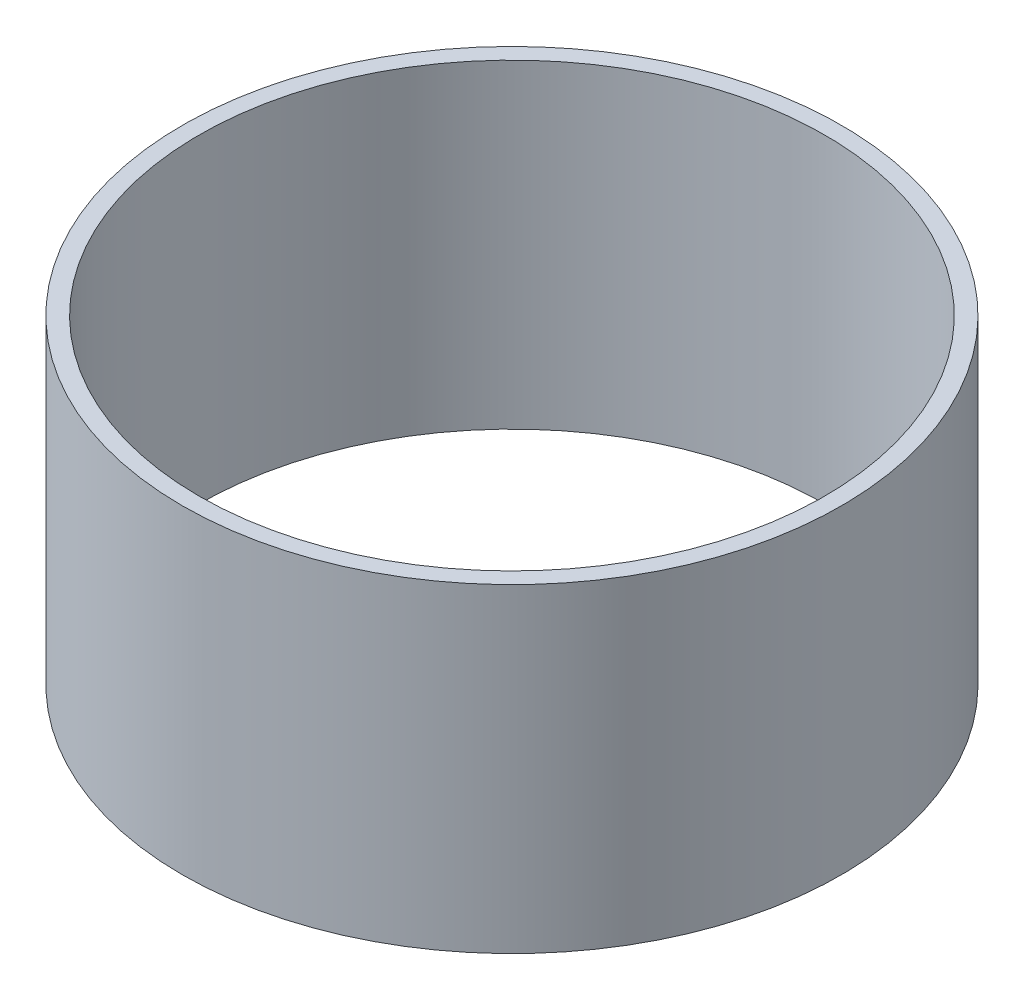
ISO-10303-21;
HEADER;
FILE_DESCRIPTION(('STEP AP214'),'2;1');
FILE_NAME('part.step','',(''),(''),'','','');
FILE_SCHEMA(('AUTOMOTIVE_DESIGN { 1 0 10303 214 1 1 1 1 }'));
ENDSEC;
DATA;
#1=APPLICATION_CONTEXT('core data for automotive mechanical design processes');
#2=APPLICATION_PROTOCOL_DEFINITION('international standard','automotive_design',2000,#1);
#3=PRODUCT_CONTEXT('',#1,'mechanical');
#4=PRODUCT('Part','Part','',(#3));
#5=PRODUCT_RELATED_PRODUCT_CATEGORY('part','',(#4));
#6=PRODUCT_DEFINITION_FORMATION('','',#4);
#7=PRODUCT_DEFINITION_CONTEXT('part definition',#1,'design');
#8=PRODUCT_DEFINITION('design','',#6,#7);
#9=PRODUCT_DEFINITION_SHAPE('','',#8);
#10=(LENGTH_UNIT() NAMED_UNIT(*) SI_UNIT(.MILLI.,.METRE.));
#11=(NAMED_UNIT(*) PLANE_ANGLE_UNIT() SI_UNIT($,.RADIAN.));
#12=(NAMED_UNIT(*) SI_UNIT($,.STERADIAN.) SOLID_ANGLE_UNIT());
#13=UNCERTAINTY_MEASURE_WITH_UNIT(LENGTH_MEASURE(1.E-05),#10,'distance_accuracy_value','');
#14=(GEOMETRIC_REPRESENTATION_CONTEXT(3) GLOBAL_UNCERTAINTY_ASSIGNED_CONTEXT((#13)) GLOBAL_UNIT_ASSIGNED_CONTEXT((#10,
#11,#12)) REPRESENTATION_CONTEXT('',''));
#15=CARTESIAN_POINT('',(0.,0.,0.));
#16=DIRECTION('',(0.,0.,1.));
#17=DIRECTION('',(1.,0.,0.));
#18=AXIS2_PLACEMENT_3D('',#15,#16,#17);
#19=CARTESIAN_POINT('',(0.,45.40758,0.));
#20=DIRECTION('',(0.,1.,0.));
#21=DIRECTION('',(0.,0.,1.));
#22=AXIS2_PLACEMENT_3D('',#19,#20,#21);
#23=PLANE('',#22);
#24=CARTESIAN_POINT('',(0.,45.40758,0.));
#25=DIRECTION('',(0.,1.,0.));
#26=DIRECTION('',(0.,0.,1.));
#27=AXIS2_PLACEMENT_3D('',#24,#25,#26);
#28=CIRCLE('',#27,93.6625);
#29=CARTESIAN_POINT('',(0.,45.40758,93.6625));
#30=VERTEX_POINT('',#29);
#31=EDGE_CURVE('E10',#30,#30,#28,.T.);
#32=ORIENTED_EDGE('',*,*,#31,.T.);
#33=EDGE_LOOP('',(#32));
#34=FACE_BOUND('',#33,.T.);
#35=CARTESIAN_POINT('',(0.,45.40758,0.));
#36=DIRECTION('',(0.,1.,0.));
#37=DIRECTION('',(0.,0.,1.));
#38=AXIS2_PLACEMENT_3D('',#35,#36,#37);
#39=CIRCLE('',#38,88.9);
#40=CARTESIAN_POINT('',(0.,45.40758,88.9));
#41=VERTEX_POINT('',#40);
#42=EDGE_CURVE('E50',#41,#41,#39,.T.);
#43=ORIENTED_EDGE('',*,*,#42,.F.);
#44=EDGE_LOOP('',(#43));
#45=FACE_BOUND('',#44,.T.);
#46=ADVANCED_FACE('F37',(#34,#45),#23,.T.);
#47=CARTESIAN_POINT('',(0.,-45.40758,0.));
#48=DIRECTION('',(0.,1.,0.));
#49=DIRECTION('',(0.,0.,1.));
#50=AXIS2_PLACEMENT_3D('',#47,#48,#49);
#51=PLANE('',#50);
#52=CARTESIAN_POINT('',(0.,-45.40758,0.));
#53=DIRECTION('',(0.,1.,0.));
#54=DIRECTION('',(0.,0.,1.));
#55=AXIS2_PLACEMENT_3D('',#52,#53,#54);
#56=CIRCLE('',#55,93.6625);
#57=CARTESIAN_POINT('',(0.,-45.40758,93.6625));
#58=VERTEX_POINT('',#57);
#59=EDGE_CURVE('E41',#58,#58,#56,.T.);
#60=ORIENTED_EDGE('',*,*,#59,.F.);
#61=EDGE_LOOP('',(#60));
#62=FACE_BOUND('',#61,.T.);
#63=CARTESIAN_POINT('',(0.,-45.40758,0.));
#64=DIRECTION('',(0.,1.,0.));
#65=DIRECTION('',(0.,0.,1.));
#66=AXIS2_PLACEMENT_3D('',#63,#64,#65);
#67=CIRCLE('',#66,88.9);
#68=CARTESIAN_POINT('',(0.,-45.40758,88.9));
#69=VERTEX_POINT('',#68);
#70=EDGE_CURVE('E52',#69,#69,#67,.T.);
#71=ORIENTED_EDGE('',*,*,#70,.T.);
#72=EDGE_LOOP('',(#71));
#73=FACE_BOUND('',#72,.T.);
#74=ADVANCED_FACE('F64',(#62,#73),#51,.F.);
#75=CARTESIAN_POINT('',(0.,45.40758,0.));
#76=DIRECTION('',(0.,-1.,0.));
#77=DIRECTION('',(0.,0.,-1.));
#78=AXIS2_PLACEMENT_3D('',#75,#76,#77);
#79=CYLINDRICAL_SURFACE('',#78,93.6625);
#80=ORIENTED_EDGE('',*,*,#31,.F.);
#81=EDGE_LOOP('',(#80));
#82=FACE_BOUND('',#81,.T.);
#83=ORIENTED_EDGE('',*,*,#59,.T.);
#84=EDGE_LOOP('',(#83));
#85=FACE_BOUND('',#84,.T.);
#86=ADVANCED_FACE('F39',(#82,#85),#79,.T.);
#87=CARTESIAN_POINT('',(0.,45.40758,0.));
#88=DIRECTION('',(0.,-1.,0.));
#89=DIRECTION('',(0.,0.,-1.));
#90=AXIS2_PLACEMENT_3D('',#87,#88,#89);
#91=CYLINDRICAL_SURFACE('',#90,88.9);
#92=ORIENTED_EDGE('',*,*,#42,.T.);
#93=EDGE_LOOP('',(#92));
#94=FACE_BOUND('',#93,.T.);
#95=ORIENTED_EDGE('',*,*,#70,.F.);
#96=EDGE_LOOP('',(#95));
#97=FACE_BOUND('',#96,.T.);
#98=ADVANCED_FACE('F60',(#94,#97),#91,.F.);
#99=CLOSED_SHELL('',(#46,#74,#86,#98));
#100=MANIFOLD_SOLID_BREP('B2',#99);
#101=ADVANCED_BREP_SHAPE_REPRESENTATION('',(#18,#100),#14);
#102=SHAPE_DEFINITION_REPRESENTATION(#9,#101);
ENDSEC;
END-ISO-10303-21;
